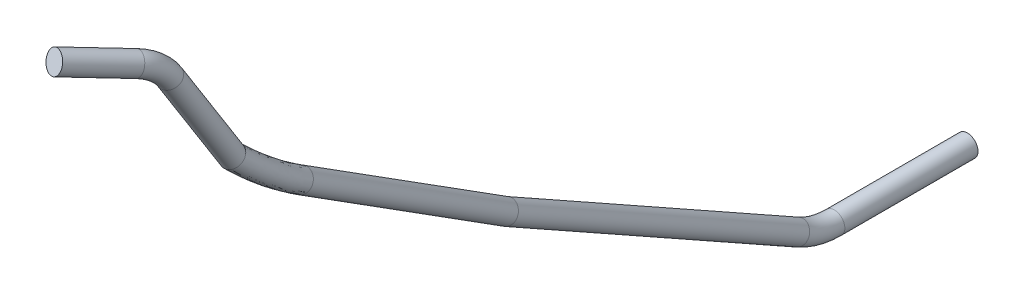
ISO-10303-21;
HEADER;
FILE_DESCRIPTION(('STEP AP214'),'2;1');
FILE_NAME('part.step','',(''),(''),'','','');
FILE_SCHEMA(('AUTOMOTIVE_DESIGN { 1 0 10303 214 1 1 1 1 }'));
ENDSEC;
DATA;
#1=APPLICATION_CONTEXT('core data for automotive mechanical design processes');
#2=APPLICATION_PROTOCOL_DEFINITION('international standard','automotive_design',2000,#1);
#3=PRODUCT_CONTEXT('',#1,'mechanical');
#4=PRODUCT('Part','Part','',(#3));
#5=PRODUCT_RELATED_PRODUCT_CATEGORY('part','',(#4));
#6=PRODUCT_DEFINITION_FORMATION('','',#4);
#7=PRODUCT_DEFINITION_CONTEXT('part definition',#1,'design');
#8=PRODUCT_DEFINITION('design','',#6,#7);
#9=PRODUCT_DEFINITION_SHAPE('','',#8);
#10=(LENGTH_UNIT() NAMED_UNIT(*) SI_UNIT(.MILLI.,.METRE.));
#11=(NAMED_UNIT(*) PLANE_ANGLE_UNIT() SI_UNIT($,.RADIAN.));
#12=(NAMED_UNIT(*) SI_UNIT($,.STERADIAN.) SOLID_ANGLE_UNIT());
#13=UNCERTAINTY_MEASURE_WITH_UNIT(LENGTH_MEASURE(1.E-05),#10,'distance_accuracy_value','');
#14=(GEOMETRIC_REPRESENTATION_CONTEXT(3) GLOBAL_UNCERTAINTY_ASSIGNED_CONTEXT((#13)) GLOBAL_UNIT_ASSIGNED_CONTEXT((#10,
#11,#12)) REPRESENTATION_CONTEXT('',''));
#15=CARTESIAN_POINT('',(0.,0.,0.));
#16=DIRECTION('',(0.,0.,1.));
#17=DIRECTION('',(1.,0.,0.));
#18=AXIS2_PLACEMENT_3D('',#15,#16,#17);
#19=CARTESIAN_POINT('',(-510.773209160921,517.745133017637,1525.04513957571));
#20=DIRECTION('',(0.276276169765513,-0.333500478289716,-0.901359478232868));
#21=DIRECTION('',(0.,0.93786269894796,-0.34700656754887));
#22=AXIS2_PLACEMENT_3D('',#19,#20,#21);
#23=PLANE('',#22);
#24=CARTESIAN_POINT('',(-510.773209160921,517.745133017637,1525.04513957571));
#25=DIRECTION('',(0.276276169765513,-0.333500478289716,-0.901359478232868));
#26=DIRECTION('',(0.,0.93786269894796,-0.34700656754887));
#27=AXIS2_PLACEMENT_3D('',#24,#25,#26);
#28=CIRCLE('',#27,10.);
#29=CARTESIAN_POINT('',(-510.773209160921,527.123760007117,1521.57507390022));
#30=VERTEX_POINT('',#29);
#31=EDGE_CURVE('E48',#30,#30,#28,.T.);
#32=ORIENTED_EDGE('',*,*,#31,.F.);
#33=EDGE_LOOP('',(#32));
#34=FACE_BOUND('',#33,.T.);
#35=ADVANCED_FACE('F45',(#34),#23,.F.);
#36=CARTESIAN_POINT('',(-482.88979308778,48.2309975051512,693.979558270394));
#37=DIRECTION('',(0.,0.,-1.));
#38=DIRECTION('',(0.0684911380918414,0.997651724803242,0.));
#39=AXIS2_PLACEMENT_3D('',#36,#37,#38);
#40=PLANE('',#39);
#41=CARTESIAN_POINT('',(-482.88979308778,48.2309975051512,693.979558270394));
#42=DIRECTION('',(0.,0.,-1.));
#43=DIRECTION('',(0.0684911380918414,0.997651724803242,0.));
#44=AXIS2_PLACEMENT_3D('',#41,#42,#43);
#45=CIRCLE('',#44,10.);
#46=CARTESIAN_POINT('',(-482.204881706862,58.2075147531837,693.979558270394));
#47=VERTEX_POINT('',#46);
#48=EDGE_CURVE('E12',#47,#47,#45,.T.);
#49=ORIENTED_EDGE('',*,*,#48,.T.);
#50=EDGE_LOOP('',(#49));
#51=FACE_BOUND('',#50,.T.);
#52=ADVANCED_FACE('F111',(#51),#40,.T.);
#53=CARTESIAN_POINT('',(-508.911169223926,450.114013071726,1477.83973627585));
#54=DIRECTION('',(0.904338528167801,-0.227267213397239,0.361277511320521));
#55=DIRECTION('',(0.370985292650153,0.,-0.928638741727525));
#56=AXIS2_PLACEMENT_3D('',#53,#54,#55);
#57=TOROIDAL_SURFACE('',#56,50.0000000000003,10.);
#58=CARTESIAN_POINT('',(-487.570375446822,474.209237825209,1439.57760532314));
#59=DIRECTION('',(0.000186699067691753,-0.846237361114661,-0.5328060564569));
#60=DIRECTION('',(0.0954890480492274,0.530386484482647,-0.842360978904407));
#61=AXIS2_PLACEMENT_3D('',#58,#59,#60);
#62=CIRCLE('',#61,10.);
#63=CARTESIAN_POINT('',(-483.302216691401,479.028282775905,1431.9251791326));
#64=VERTEX_POINT('',#63);
#65=EDGE_CURVE('E97',#64,#64,#62,.T.);
#66=CARTESIAN_POINT('',(-492.644385238532,495.861336618991,1465.89929545339));
#67=DIRECTION('',(0.276276169765513,-0.333500478289716,-0.901359478232868));
#68=DIRECTION('',(0.,0.93786269894796,-0.34700656754887));
#69=AXIS2_PLACEMENT_3D('',#66,#67,#68);
#70=CIRCLE('',#69,10.);
#71=CARTESIAN_POINT('',(-489.391028441454,505.010801328442,1463.5112072889));
#72=VERTEX_POINT('',#71);
#73=EDGE_CURVE('E149',#72,#72,#70,.T.);
#74=CARTESIAN_POINT('',(-508.911169223926,450.114013071726,1477.83973627585));
#75=DIRECTION('',(0.904338528167801,-0.227267213397239,0.361277511320521));
#76=DIRECTION('',(0.370985292650153,0.,-0.928638741727525));
#77=AXIS2_PLACEMENT_3D('',#74,#75,#76);
#78=CIRCLE('',#77,60.0000000000003);
#79=EDGE_CURVE('',#64,#72,#78,.T.);
#80=ORIENTED_EDGE('',*,*,#65,.F.);
#81=ORIENTED_EDGE('',*,*,#73,.T.);
#82=ORIENTED_EDGE('',*,*,#79,.T.);
#83=ORIENTED_EDGE('',*,*,#79,.F.);
#84=EDGE_LOOP('',(#80,#82,#81,#83));
#85=FACE_BOUND('',#84,.T.);
#86=ADVANCED_FACE('F106',(#85),#57,.T.);
#87=CARTESIAN_POINT('',(-492.644385238532,495.861336618989,1465.89929545339));
#88=DIRECTION('',(-0.276276169765517,0.333500478289714,0.901359478232868));
#89=DIRECTION('',(0.,-0.93786269894796,0.347006567548869));
#90=AXIS2_PLACEMENT_3D('',#87,#88,#89);
#91=CYLINDRICAL_SURFACE('',#90,10.);
#92=ORIENTED_EDGE('',*,*,#31,.T.);
#93=EDGE_LOOP('',(#92));
#94=FACE_BOUND('',#93,.T.);
#95=ORIENTED_EDGE('',*,*,#73,.F.);
#96=EDGE_LOOP('',(#95));
#97=FACE_BOUND('',#96,.T.);
#98=ADVANCED_FACE('F110',(#94,#97),#91,.T.);
#99=CARTESIAN_POINT('',(-487.549230938787,378.369055535432,1379.23492616198));
#100=DIRECTION('',(-0.000186699067695459,0.84623736111466,0.532806056456901));
#101=DIRECTION('',(0.,-0.53280606574279,0.846237375863114));
#102=AXIS2_PLACEMENT_3D('',#99,#100,#101);
#103=CYLINDRICAL_SURFACE('',#102,10.);
#104=CARTESIAN_POINT('',(-478.669114475622,378.086138604802,1384.48941735097));
#105=CARTESIAN_POINT('',(-478.662993129697,378.093934910784,1384.48035219592));
#106=CARTESIAN_POINT('',(-478.656895292657,378.101737945794,1384.47127648724));
#107=CARTESIAN_POINT('',(-478.52197824618,378.27520067755,1384.26946145875));
#108=CARTESIAN_POINT('',(-478.403735906803,378.443848629474,1384.07202260607));
#109=CARTESIAN_POINT('',(-478.189387779546,378.7858441776,1383.66923844098));
#110=CARTESIAN_POINT('',(-478.093293947711,378.959194255904,1383.46388892778));
#111=CARTESIAN_POINT('',(-477.923787516122,379.309724497188,1383.04631278206));
#112=CARTESIAN_POINT('',(-477.850425295129,379.486912249326,1382.8340720099));
#113=CARTESIAN_POINT('',(-477.727175609425,379.843614330729,1382.40450228013));
#114=CARTESIAN_POINT('',(-477.677306101837,380.023130332298,1382.18716956315));
#115=CARTESIAN_POINT('',(-477.601576644349,380.382748074651,1381.74952167354));
#116=CARTESIAN_POINT('',(-477.575672319506,380.562848110708,1381.52921278262));
#117=CARTESIAN_POINT('',(-477.547929160334,380.922763429279,1381.08668563078));
#118=CARTESIAN_POINT('',(-477.546101284487,381.102578544882,1380.86446654648));
#119=CARTESIAN_POINT('',(-477.566594790252,381.460556159507,1380.41980325884));
#120=CARTESIAN_POINT('',(-477.588916568563,381.638718631332,1380.19735905188));
#121=CARTESIAN_POINT('',(-477.657581313641,381.992021492111,1379.75395019945));
#122=CARTESIAN_POINT('',(-477.703913199185,382.167163236705,1379.53298491905));
#123=CARTESIAN_POINT('',(-477.820119533795,382.512676132922,1379.09473880854));
#124=CARTESIAN_POINT('',(-477.88991717385,382.683060909519,1378.8774483562));
#125=CARTESIAN_POINT('',(-478.052561364108,383.018249141319,1378.44759687986));
#126=CARTESIAN_POINT('',(-478.145385660272,383.183057811787,1378.23503150421));
#127=CARTESIAN_POINT('',(-478.353547884815,383.506137522083,1377.8158576317));
#128=CARTESIAN_POINT('',(-478.468896444814,383.664405431713,1377.60925200096));
#129=CARTESIAN_POINT('',(-478.721320583853,383.973189086137,1377.20356669031));
#130=CARTESIAN_POINT('',(-478.858401025595,384.123703085914,1377.00448870716));
#131=CARTESIAN_POINT('',(-479.152067507544,384.414585692519,1376.61701974958));
#132=CARTESIAN_POINT('',(-479.308478762728,384.555029341731,1376.42855262594));
#133=CARTESIAN_POINT('',(-479.640621553467,384.826127551448,1376.06187345161));
#134=CARTESIAN_POINT('',(-479.816353314096,384.956781997886,1375.88366152042));
#135=CARTESIAN_POINT('',(-480.185885308199,385.207324595951,1375.53880990604));
#136=CARTESIAN_POINT('',(-480.379684216672,385.327213535832,1375.37216937578));
#137=CARTESIAN_POINT('',(-480.783985633648,385.555347538131,1375.05166507684));
#138=CARTESIAN_POINT('',(-480.994488249891,385.663592525436,1374.89780139059));
#139=CARTESIAN_POINT('',(-481.428961192961,385.866826333331,1374.60514199357));
#140=CARTESIAN_POINT('',(-481.652812035569,385.961913088954,1374.46623688469));
#141=CARTESIAN_POINT('',(-482.113869314488,386.139135122014,1374.20311952857));
#142=CARTESIAN_POINT('',(-482.351075398706,386.221270740673,1374.07890689425));
#143=CARTESIAN_POINT('',(-482.837149291059,386.371992997735,1373.84606572547));
#144=CARTESIAN_POINT('',(-483.086016931564,386.440579830822,1373.73743696709));
#145=CARTESIAN_POINT('',(-483.593632977505,386.563709276867,1373.53653783484));
#146=CARTESIAN_POINT('',(-483.85238137344,386.618251903328,1373.44426744524));
#147=CARTESIAN_POINT('',(-484.376850234036,386.712713913463,1373.27707274189));
#148=CARTESIAN_POINT('',(-484.642538734282,386.752690817248,1373.20208063743));
#149=CARTESIAN_POINT('',(-485.179980570903,386.8180488205,1373.06949032993));
#150=CARTESIAN_POINT('',(-485.451733885574,386.843429972193,1373.01189206466));
#151=CARTESIAN_POINT('',(-485.999376050314,386.879430115634,1372.91447650805));
#152=CARTESIAN_POINT('',(-486.275264945257,386.890048947079,1372.87465940981));
#153=CARTESIAN_POINT('',(-486.829219683874,386.896467898177,1372.81306239052));
#154=CARTESIAN_POINT('',(-487.107285533231,386.892267979126,1372.79128251658));
#155=CARTESIAN_POINT('',(-487.664140220088,386.869081805176,1372.76585943647));
#156=CARTESIAN_POINT('',(-487.942929449125,386.850068489573,1372.76224951279));
#157=CARTESIAN_POINT('',(-488.498756859029,386.79738471713,1372.7732463841));
#158=CARTESIAN_POINT('',(-488.775795039071,386.763714253383,1372.78785318768));
#159=CARTESIAN_POINT('',(-489.326160341181,386.681986995313,1372.83514160247));
#160=CARTESIAN_POINT('',(-489.599487729363,386.633931238365,1372.86782191049));
#161=CARTESIAN_POINT('',(-490.140551157858,386.523801858656,1372.95098913939));
#162=CARTESIAN_POINT('',(-490.408287179016,386.461728187881,1373.00147612126));
#163=CARTESIAN_POINT('',(-490.93806822879,386.32357264448,1373.12025949041));
#164=CARTESIAN_POINT('',(-491.200063843217,386.247400748695,1373.18867157536));
#165=CARTESIAN_POINT('',(-491.714702667901,386.08189154658,1373.34262900293));
#166=CARTESIAN_POINT('',(-491.96734559039,385.99255383558,1373.42817487221));
#167=CARTESIAN_POINT('',(-492.461656336918,385.801321941284,1373.61581537703));
#168=CARTESIAN_POINT('',(-492.703318413072,385.69942128326,1373.71791855456));
#169=CARTESIAN_POINT('',(-493.173862718965,385.483843048954,1373.93789773904));
#170=CARTESIAN_POINT('',(-493.402745236371,385.370165737929,1374.05577339074));
#171=CARTESIAN_POINT('',(-493.849901827788,385.129843768762,1374.30856427055));
#172=CARTESIAN_POINT('',(-494.067933138663,385.003013372727,1374.44373245249));
#173=CARTESIAN_POINT('',(-494.487637442146,384.738948354546,1374.72851946913));
#174=CARTESIAN_POINT('',(-494.689310740121,384.60171392671,1374.87813803397));
#175=CARTESIAN_POINT('',(-495.074557447383,384.318082982038,1375.19047451137));
#176=CARTESIAN_POINT('',(-495.258160967227,384.171702395113,1375.35316978237));
#177=CARTESIAN_POINT('',(-495.606301108503,383.870676874761,1375.69065669564));
#178=CARTESIAN_POINT('',(-495.77084794143,383.716036432889,1375.86544177866));
#179=CARTESIAN_POINT('',(-496.01315698327,383.467835481431,1376.14813833154));
#180=CARTESIAN_POINT('',(-496.097746802385,383.376689034113,1376.25238858815));
#181=CARTESIAN_POINT('',(-496.260185392214,383.19232420307,1376.46411995269));
#182=CARTESIAN_POINT('',(-496.338038807022,383.099107303343,1376.57159876486));
#183=CARTESIAN_POINT('',(-496.418421402111,382.997393546252,1376.68933028367));
#184=CARTESIAN_POINT('',(-496.424372906815,382.989828551148,1376.69808929787));
#185=CARTESIAN_POINT('',(-496.430302155483,382.982257577575,1376.70685792588));
#186=B_SPLINE_CURVE_WITH_KNOTS('',3,(#104,#105,#106,#107,#108,#109,#110,#111,#112,#113,#114,
#115,#116,#117,#118,#119,#120,#121,#122,#123,#124,#125,#126,#127,#128,#129,#130,#131,#132,#133,
#134,#135,#136,#137,#138,#139,#140,#141,#142,#143,#144,#145,#146,#147,#148,#149,#150,#151,#152,
#153,#154,#155,#156,#157,#158,#159,#160,#161,#162,#163,#164,#165,#166,#167,#168,#169,#170,#171,
#172,#173,#174,#175,#176,#177,#178,#179,#180,#181,#182,#183,#184,#185),.UNSPECIFIED.,.F.,.F.,(4,
2,2,2,2,2,2,2,2,2,2,2,2,2,2,2,2,2,2,2,2,2,2,2,2,2,2,2,2,2,2,2,2,2,2,2,2,2,2,2,4),(0.,
0.0402982036311879,0.895072024434754,1.75030618789731,2.60742242016678,3.46519274748777,
4.32137159349368,5.17794011892683,6.03452271517708,6.89071033025851,7.74412229121158,
8.59671266635808,9.4497064474532,10.3028913635743,11.1488600321391,11.9948385568444,
12.8407550882546,13.686677076254,14.5259187066739,15.3651382219519,16.2043456775288,
17.0435523262327,17.8794080741336,18.715260831283,19.551122664783,20.3869866814279,
21.2243812219297,22.0617761569949,22.8991107190465,23.7364481491831,24.5793293376308,
25.4222364386441,26.2655797900381,27.1089041500956,27.9663936625348,28.8238671639325,
29.6798867229593,30.535445441964,31.0221002647636,31.508416867894,31.5474594090479),.UNSPECIFIED.);
#187=CARTESIAN_POINT('',(-478.669114475622,378.086138604802,1384.48941735097));
#188=VERTEX_POINT('',#187);
#189=CARTESIAN_POINT('',(-496.430302155483,382.982257577575,1376.70685792588));
#190=VERTEX_POINT('',#189);
#191=EDGE_CURVE('E78',#188,#190,#186,.T.);
#192=ORIENTED_EDGE('',*,*,#191,.T.);
#193=CARTESIAN_POINT('',(-478.669114475622,378.086138604802,1384.48941735097));
#194=CARTESIAN_POINT('',(-478.675235050756,378.07833314002,1384.49847514978));
#195=CARTESIAN_POINT('',(-478.681379413699,378.070534008548,1384.50752279865));
#196=CARTESIAN_POINT('',(-478.818386836975,377.897439676585,1384.70826454955));
#197=CARTESIAN_POINT('',(-478.959902734105,377.735019541787,1384.89536529245));
#198=CARTESIAN_POINT('',(-479.26322259874,377.417202634959,1385.25890855017));
#199=CARTESIAN_POINT('',(-479.425037443763,377.26180968976,1385.43534527483));
#200=CARTESIAN_POINT('',(-479.768181628337,376.95885642167,1385.77663380081));
#201=CARTESIAN_POINT('',(-479.949553110378,376.811314079834,1385.94145926542));
#202=CARTESIAN_POINT('',(-480.330380406983,376.525393227872,1386.25801835056));
#203=CARTESIAN_POINT('',(-480.529849930431,376.387021804147,1386.40974187397));
#204=CARTESIAN_POINT('',(-480.944973200159,376.120808136234,1386.69859326929));
#205=CARTESIAN_POINT('',(-481.160596417211,375.992946942451,1386.83574754569));
#206=CARTESIAN_POINT('',(-481.606938093665,375.748343403015,1387.09483713652));
#207=CARTESIAN_POINT('',(-481.837663379514,375.631606144982,1387.21676549509));
#208=CARTESIAN_POINT('',(-482.312498674599,375.410171562563,1387.44443050278));
#209=CARTESIAN_POINT('',(-482.556608884659,375.305474418897,1387.55016690888));
#210=CARTESIAN_POINT('',(-483.056366417972,375.108945166143,1387.7446073122));
#211=CARTESIAN_POINT('',(-483.312008365642,375.017107142994,1387.83331914623));
#212=CARTESIAN_POINT('',(-483.832218424556,374.847222021669,1387.99281930445));
#213=CARTESIAN_POINT('',(-484.096752888692,374.769128673034,1388.06366809949));
#214=CARTESIAN_POINT('',(-484.633434028599,374.627008972894,1388.18722856326));
#215=CARTESIAN_POINT('',(-484.905573131744,374.562969152872,1388.23995762513));
#216=CARTESIAN_POINT('',(-485.455889411817,374.449328317888,1388.32697191664));
#217=CARTESIAN_POINT('',(-485.734069378128,374.399734132416,1388.36124842892));
#218=CARTESIAN_POINT('',(-486.294400255758,374.31540771895,1388.4110353681));
#219=CARTESIAN_POINT('',(-486.576552042332,374.280678821449,1388.42654159104));
#220=CARTESIAN_POINT('',(-487.140278833171,374.22661719347,1388.43856962611));
#221=CARTESIAN_POINT('',(-487.421837942713,374.20715466914,1388.43525350089));
#222=CARTESIAN_POINT('',(-487.984764795839,374.183300774878,1388.41000130141));
#223=CARTESIAN_POINT('',(-488.266132537139,374.178909581747,1388.38806500874));
#224=CARTESIAN_POINT('',(-488.826619290101,374.185255847581,1388.32570147695));
#225=CARTESIAN_POINT('',(-489.105738464337,374.195992202757,1388.28527558709));
#226=CARTESIAN_POINT('',(-489.659726880241,374.232535387789,1388.18619945775));
#227=CARTESIAN_POINT('',(-489.934596093878,374.258342317001,1388.12754909813));
#228=CARTESIAN_POINT('',(-490.475964718138,374.324596484886,1387.99295673204));
#229=CARTESIAN_POINT('',(-490.742512620569,374.364928215296,1387.91715285858));
#230=CARTESIAN_POINT('',(-491.267533721823,374.459980806488,1387.74853539607));
#231=CARTESIAN_POINT('',(-491.526007131116,374.51470129186,1387.65572225082));
#232=CARTESIAN_POINT('',(-492.033027386257,374.638144281369,1387.45374510619));
#233=CARTESIAN_POINT('',(-492.28157435609,374.706866610551,1387.34458131113));
#234=CARTESIAN_POINT('',(-492.766964226614,374.857821218826,1387.11068429728));
#235=CARTESIAN_POINT('',(-493.003807135982,374.940053487901,1386.98595109005));
#236=CARTESIAN_POINT('',(-493.463238330205,375.117102826328,1386.72230746469));
#237=CARTESIAN_POINT('',(-493.685876449794,375.211871852393,1386.58345161475));
#238=CARTESIAN_POINT('',(-494.116285030197,375.413546758528,1386.29217630705));
#239=CARTESIAN_POINT('',(-494.324055542769,375.520452596343,1386.1397568965));
#240=CARTESIAN_POINT('',(-494.723274496101,375.745631299071,1385.82244797662));
#241=CARTESIAN_POINT('',(-494.914722844308,375.863904228429,1385.65755839659));
#242=CARTESIAN_POINT('',(-495.27996642617,376.110965205953,1385.31649215815));
#243=CARTESIAN_POINT('',(-495.453761606842,376.239753285676,1385.14031546587));
#244=CARTESIAN_POINT('',(-495.782829079179,376.507184436161,1384.77757598432));
#245=CARTESIAN_POINT('',(-495.938064006363,376.645846518708,1384.59099331731));
#246=CARTESIAN_POINT('',(-496.228551943711,376.931803379546,1384.20909541631));
#247=CARTESIAN_POINT('',(-496.363804970085,377.079098150835,1384.01378018939));
#248=CARTESIAN_POINT('',(-496.613416120191,377.381263034121,1383.61581360725));
#249=CARTESIAN_POINT('',(-496.727775110988,377.536132831429,1383.41316255687));
#250=CARTESIAN_POINT('',(-496.934851871187,377.852355331472,1383.00194794069));
#251=CARTESIAN_POINT('',(-497.027569445771,378.013708092551,1382.79338432168));
#252=CARTESIAN_POINT('',(-497.192031181013,378.344304767838,1382.36853803502));
#253=CARTESIAN_POINT('',(-497.263427879613,378.513632241879,1382.15218582432));
#254=CARTESIAN_POINT('',(-497.382828217657,378.856580867203,1381.71644671646));
#255=CARTESIAN_POINT('',(-497.430831385493,379.030202104972,1381.4970597582));
#256=CARTESIAN_POINT('',(-497.503170628501,379.380580601546,1381.05670949309));
#257=CARTESIAN_POINT('',(-497.527494713375,379.55733940303,1380.83574544465));
#258=CARTESIAN_POINT('',(-497.552308357884,379.912641647088,1380.39392854758));
#259=CARTESIAN_POINT('',(-497.5527987651,380.091185025973,1380.17307569528));
#260=CARTESIAN_POINT('',(-497.529981761293,380.448892329533,1379.73291726758));
#261=CARTESIAN_POINT('',(-497.506661814373,380.628056531546,1379.5136125685));
#262=CARTESIAN_POINT('',(-497.436405886527,380.985649763547,1379.07820939329));
#263=CARTESIAN_POINT('',(-497.389469992386,381.164078796234,1378.86211090538));
#264=CARTESIAN_POINT('',(-497.272448936523,381.518635818493,1378.43501127496));
#265=CARTESIAN_POINT('',(-497.202403882976,381.694767249032,1378.22400197582));
#266=CARTESIAN_POINT('',(-497.039680147231,382.043747636565,1377.8082443148));
#267=CARTESIAN_POINT('',(-496.947013454038,382.216598280182,1377.60349270094));
#268=CARTESIAN_POINT('',(-496.784467258654,382.484203187246,1377.28835509349));
#269=CARTESIAN_POINT('',(-496.722006246479,382.58047589094,1377.17536967274));
#270=CARTESIAN_POINT('',(-496.590163685169,382.771329078121,1376.95216475641));
#271=CARTESIAN_POINT('',(-496.520786880757,382.865910670001,1376.84194342857));
#272=CARTESIAN_POINT('',(-496.442139963331,382.967126670224,1376.72441895122));
#273=CARTESIAN_POINT('',(-496.43623210725,382.974695234097,1376.71563351766));
#274=CARTESIAN_POINT('',(-496.430302155483,382.982257577575,1376.70685792588));
#275=B_SPLINE_CURVE_WITH_KNOTS('',3,(#193,#194,#195,#196,#197,#198,#199,#200,#201,#202,#203,
#204,#205,#206,#207,#208,#209,#210,#211,#212,#213,#214,#215,#216,#217,#218,#219,#220,#221,#222,
#223,#224,#225,#226,#227,#228,#229,#230,#231,#232,#233,#234,#235,#236,#237,#238,#239,#240,#241,
#242,#243,#244,#245,#246,#247,#248,#249,#250,#251,#252,#253,#254,#255,#256,#257,#258,#259,#260,
#261,#262,#263,#264,#265,#266,#267,#268,#269,#270,#271,#272,#273,#274),.UNSPECIFIED.,.F.,.F.,(4,
2,2,2,2,2,2,2,2,2,2,2,2,2,2,2,2,2,2,2,2,2,2,2,2,2,2,2,2,2,2,2,2,2,2,2,2,2,2,2,4),(0.,
0.0402982190755889,0.895115756452579,1.75039333416005,2.60755223992403,3.46536593423655,
4.32159745223435,5.1782187136332,6.03485283104101,6.89109166904333,7.74439178277661,
8.59687051055848,9.44975161464495,10.3028237025977,11.1485619435424,11.9943101057213,
12.8399965605697,13.6856885908621,14.5247986295333,15.3638867776155,16.2029644417753,
17.042041483804,17.87799144549,18.7139384968843,19.5498902880608,20.3858445880716,
21.2234544176535,22.0610635677983,22.898637950789,23.7362198734526,24.5867877839976,
25.4373728411033,26.2883883824568,27.139373659649,27.9908072026135,28.842237616759,
29.6921979976806,30.5417088913264,31.0246953114949,31.5073526200083,31.5463951468787),.UNSPECIFIED.);
#276=EDGE_CURVE('E74',#188,#190,#275,.T.);
#277=ORIENTED_EDGE('',*,*,#276,.F.);
#278=EDGE_LOOP('',(#192,#277));
#279=FACE_BOUND('',#278,.T.);
#280=ORIENTED_EDGE('',*,*,#65,.T.);
#281=EDGE_LOOP('',(#280));
#282=FACE_BOUND('',#281,.T.);
#283=ADVANCED_FACE('F82',(#279,#282),#103,.T.);
#284=CARTESIAN_POINT('',(-482.88979308778,210.794167038828,1127.19481864821));
#285=DIRECTION('',(0.,0.534844690679892,0.844950387213078));
#286=DIRECTION('',(0.,-0.844950387213078,0.534844690679892));
#287=AXIS2_PLACEMENT_3D('',#284,#285,#286);
#288=CYLINDRICAL_SURFACE('',#287,10.);
#289=CARTESIAN_POINT('',(-482.88979308778,211.024040943275,1127.55797462219));
#290=DIRECTION('',(0.,0.512339000942188,0.858783295199412));
#291=DIRECTION('',(0.,-0.858783295199412,0.512339000942188));
#292=AXIS2_PLACEMENT_3D('',#289,#290,#291);
#293=ELLIPSE('',#292,10.0034904950001,10.);
#294=CARTESIAN_POINT('',(-482.889793087779,202.433210412483,1132.68315294834));
#295=VERTEX_POINT('',#294);
#296=EDGE_CURVE('E64',#295,#295,#293,.T.);
#297=ORIENTED_EDGE('',*,*,#296,.T.);
#298=EDGE_LOOP('',(#297));
#299=FACE_BOUND('',#298,.T.);
#300=CARTESIAN_POINT('',(-482.88979308778,333.201927063564,1320.57522614428));
#301=DIRECTION('',(0.,-0.534844690679894,-0.844950387213077));
#302=DIRECTION('',(0.0684911380918414,0.842966211176294,-0.533588728158653));
#303=AXIS2_PLACEMENT_3D('',#300,#301,#302);
#304=CIRCLE('',#303,10.);
#305=CARTESIAN_POINT('',(-482.204881706861,341.631589175327,1315.23933886269));
#306=VERTEX_POINT('',#305);
#307=EDGE_CURVE('E80',#306,#306,#304,.T.);
#308=ORIENTED_EDGE('',*,*,#307,.T.);
#309=EDGE_LOOP('',(#308));
#310=FACE_BOUND('',#309,.T.);
#311=ADVANCED_FACE('F105',(#299,#310),#288,.T.);
#312=CARTESIAN_POINT('',(-482.204881706861,341.631589175327,1315.23933886269));
#313=CARTESIAN_POINT('',(-482.204881706861,341.842678382347,1315.57281867527));
#314=CARTESIAN_POINT('',(-482.205252941643,342.048790655843,1315.89726060842));
#315=CARTESIAN_POINT('',(-482.206737870567,342.467581896941,1316.55416801588));
#316=CARTESIAN_POINT('',(-482.207851564698,342.677506959207,1316.88228285621));
#317=CARTESIAN_POINT('',(-482.212306306513,343.308866138902,1317.86560403674));
#318=CARTESIAN_POINT('',(-482.216761018493,343.731884257328,1318.51978703413));
#319=CARTESIAN_POINT('',(-482.234579398032,345.007239616458,1320.47818867));
#320=CARTESIAN_POINT('',(-482.25239738809,345.865878002399,1321.77825992625));
#321=CARTESIAN_POINT('',(-482.323662488248,348.46671240046,1325.6614528828));
#322=CARTESIAN_POINT('',(-482.394922044,350.23382986609,1328.22755310514));
#323=CARTESIAN_POINT('',(-482.679854153522,355.632502513231,1335.85433572713));
#324=CARTESIAN_POINT('',(-482.964701883828,359.361409017858,1340.84348036232));
#325=CARTESIAN_POINT('',(-483.723163838868,367.065394526452,1350.61305733645));
#326=CARTESIAN_POINT('',(-484.196777243419,371.04046522939,1355.39347915047));
#327=CARTESIAN_POINT('',(-485.047494081311,377.176962461273,1362.39465985342));
#328=CARTESIAN_POINT('',(-485.354443871446,379.251437204276,1364.70015166987));
#329=CARTESIAN_POINT('',(-485.849730059731,382.40522608809,1368.11449426844));
#330=CARTESIAN_POINT('',(-486.020635405816,383.463501578008,1369.24529314399));
#331=CARTESIAN_POINT('',(-486.285680157658,385.061258207691,1370.93033062867));
#332=CARTESIAN_POINT('',(-486.375476179593,385.595567636904,1371.49014968802));
#333=CARTESIAN_POINT('',(-486.512338192105,386.399595584947,1372.32706496844));
#334=CARTESIAN_POINT('',(-486.558320191844,386.668032200786,1372.60556784601));
#335=CARTESIAN_POINT('',(-486.651006223833,387.205756354361,1373.16163200513));
#336=CARTESIAN_POINT('',(-486.697088275623,387.471478859127,1373.43553036069));
#337=CARTESIAN_POINT('',(-486.795633286558,388.03620651146,1374.01570581206));
#338=CARTESIAN_POINT('',(-486.84781892177,388.33526300489,1374.32294200561));
#339=CARTESIAN_POINT('',(-486.950862855602,388.925770960899,1374.9296021484));
#340=CARTESIAN_POINT('',(-487.002384822522,389.221024938919,1375.23293221981));
#341=CARTESIAN_POINT('',(-487.053906789403,389.516278916876,1375.53626229107));
#342=CARTESIAN_POINT('',(-462.251847210796,340.474156902299,1315.97198129403));
#343=CARTESIAN_POINT('',(-462.251847210796,340.689030436277,1316.31143960576));
#344=CARTESIAN_POINT('',(-462.252231932244,340.906514976981,1316.6538048075));
#345=CARTESIAN_POINT('',(-462.253770807431,341.340520566947,1317.33457713261));
#346=CARTESIAN_POINT('',(-462.254924961173,341.558072037865,1317.67461212112));
#347=CARTESIAN_POINT('',(-462.259541540191,342.212367988605,1318.69365656909));
#348=CARTESIAN_POINT('',(-462.264158088273,342.650754014998,1319.37160550852));
#349=CARTESIAN_POINT('',(-462.282623795176,343.972442008315,1321.40115430025));
#350=CARTESIAN_POINT('',(-462.30108909843,344.862274036134,1322.7484560994));
#351=CARTESIAN_POINT('',(-462.374943202554,347.557594655384,1326.77272233218));
#352=CARTESIAN_POINT('',(-462.448791560562,349.388910077228,1329.43204691116));
#353=CARTESIAN_POINT('',(-462.744075024217,354.983712158024,1337.33590441034));
#354=CARTESIAN_POINT('',(-463.039271043627,358.848086836955,1342.50630065617));
#355=CARTESIAN_POINT('',(-463.825287311145,366.831951940466,1352.63079850286));
#356=CARTESIAN_POINT('',(-464.316106709904,370.951433764744,1357.58488919512));
#357=CARTESIAN_POINT('',(-465.197729405925,377.310865004264,1364.84041716115));
#358=CARTESIAN_POINT('',(-465.515830435011,379.460703745899,1367.22966564057));
#359=CARTESIAN_POINT('',(-466.029109972162,382.729067242651,1370.76804855878));
#360=CARTESIAN_POINT('',(-466.206224171945,383.825789029739,1371.93992844785));
#361=CARTESIAN_POINT('',(-466.480897786407,385.481590872483,1373.68618198877));
#362=CARTESIAN_POINT('',(-466.573956025553,386.035311333381,1374.26633882422));
#363=CARTESIAN_POINT('',(-466.715790124914,386.868548969982,1375.13365856345));
#364=CARTESIAN_POINT('',(-466.763442613696,387.14673767216,1375.42227922653));
#365=CARTESIAN_POINT('',(-466.859495854671,387.703996911557,1375.99854474922));
#366=CARTESIAN_POINT('',(-466.908129543775,387.984401617048,1376.28755987821));
#367=CARTESIAN_POINT('',(-467.008441226413,388.559253485102,1376.87813650173));
#368=CARTESIAN_POINT('',(-467.059715096382,388.853084951092,1377.18000473282));
#369=CARTESIAN_POINT('',(-467.16275903019,389.443592907101,1377.78666487561));
#370=CARTESIAN_POINT('',(-467.214280997129,389.738846885122,1378.08999494703));
#371=CARTESIAN_POINT('',(-467.265802964003,390.034100863079,1378.39332501828));
#372=CARTESIAN_POINT('',(-463.621669972633,323.614832678774,1326.64375585721));
#373=CARTESIAN_POINT('',(-463.621669972633,323.835214023168,1326.9919154361));
#374=CARTESIAN_POINT('',(-463.622074322928,324.069250064991,1327.36036664117));
#375=CARTESIAN_POINT('',(-463.623691712959,324.525399024168,1328.07587260403));
#376=CARTESIAN_POINT('',(-463.62490475271,324.75405017369,1328.43325649427));
#377=CARTESIAN_POINT('',(-463.629756873858,325.441728913053,1329.50429353877));
#378=CARTESIAN_POINT('',(-463.634608962566,325.90248180263,1330.21683206427));
#379=CARTESIAN_POINT('',(-463.654016806952,327.291603547878,1332.34993032485));
#380=CARTESIAN_POINT('',(-463.673424227268,328.226835634122,1333.76597271614));
#381=CARTESIAN_POINT('',(-463.751046436399,331.059674021067,1337.99556075899));
#382=CARTESIAN_POINT('',(-463.828662606564,332.984424860368,1340.79056655476));
#383=CARTESIAN_POINT('',(-464.139011707209,338.86467895273,1349.09768621926));
#384=CARTESIAN_POINT('',(-464.449268902386,342.926217624403,1354.53188089773));
#385=CARTESIAN_POINT('',(-465.275388451952,351.317426960395,1365.17294004983));
#386=CARTESIAN_POINT('',(-465.791249912989,355.647088581897,1370.37979306187));
#387=CARTESIAN_POINT('',(-466.717853820181,362.330983923926,1378.00550482004));
#388=CARTESIAN_POINT('',(-467.052184659943,364.590509439351,1380.51665498158));
#389=CARTESIAN_POINT('',(-467.591652196732,368.02562788523,1384.2355694901));
#390=CARTESIAN_POINT('',(-467.777802927879,369.178305438992,1385.46723978211));
#391=CARTESIAN_POINT('',(-468.066490646,370.918587833013,1387.30258880481));
#392=CARTESIAN_POINT('',(-468.164296803152,371.500559627456,1387.91234578199));
#393=CARTESIAN_POINT('',(-468.313367410245,372.376309824051,1388.82391698188));
#394=CARTESIAN_POINT('',(-468.363451173398,372.668691972778,1389.12726333996));
#395=CARTESIAN_POINT('',(-468.464405140145,373.254383097457,1389.73293046597));
#396=CARTESIAN_POINT('',(-468.516752550233,373.556156669575,1390.04394695039));
#397=CARTESIAN_POINT('',(-468.619635494104,374.145743591136,1390.64966171739));
#398=CARTESIAN_POINT('',(-468.66958235652,374.431970412874,1390.9437172727));
#399=CARTESIAN_POINT('',(-468.772626290375,375.022478368883,1391.55037741549));
#400=CARTESIAN_POINT('',(-468.824148257272,375.317732346903,1391.8537074869));
#401=CARTESIAN_POINT('',(-468.875670224164,375.612986324861,1392.15703755815));
#402=CARTESIAN_POINT('',(-483.574704468698,324.772264951801,1325.91111342587));
#403=CARTESIAN_POINT('',(-483.574704468698,324.988861969238,1326.25329450561));
#404=CARTESIAN_POINT('',(-483.575095332332,325.211525743864,1326.60382244207));
#405=CARTESIAN_POINT('',(-483.576658776089,325.652460354151,1327.29546348732));
#406=CARTESIAN_POINT('',(-483.577831356228,325.873485095043,1327.64092722938));
#407=CARTESIAN_POINT('',(-483.582521640191,326.538227063327,1328.67624100637));
#408=CARTESIAN_POINT('',(-483.587211892786,326.983612044983,1329.36501358988));
#409=CARTESIAN_POINT('',(-483.605972409807,328.326401155977,1331.42696469459));
#410=CARTESIAN_POINT('',(-483.624732516906,329.230439600431,1332.79577654299));
#411=CARTESIAN_POINT('',(-483.699765722138,331.968791766054,1336.88429130961));
#412=CARTESIAN_POINT('',(-483.774793090002,333.829344649407,1339.58607274838));
#413=CARTESIAN_POINT('',(-484.074790836514,339.513469307583,1347.61611753676));
#414=CARTESIAN_POINT('',(-484.374699742587,343.439539806371,1352.86906060352));
#415=CARTESIAN_POINT('',(-485.173264979675,351.550869545316,1363.15519888378));
#416=CARTESIAN_POINT('',(-485.671920446593,355.736120046899,1368.18838301687));
#417=CARTESIAN_POINT('',(-486.567618495522,362.197081380757,1375.55974751249));
#418=CARTESIAN_POINT('',(-486.890798096378,364.381242897728,1377.98714101088));
#419=CARTESIAN_POINT('',(-487.412272284301,367.701786730669,1381.58201519976));
#420=CARTESIAN_POINT('',(-487.592214161795,368.816017987261,1382.77260447825));
#421=CARTESIAN_POINT('',(-487.871273017229,370.49825516822,1384.54673744471));
#422=CARTESIAN_POINT('',(-487.965816957159,371.06081593098,1385.13615664583));
#423=CARTESIAN_POINT('',(-488.109915477452,371.907356439016,1386.01732338685));
#424=CARTESIAN_POINT('',(-488.158328751536,372.189986501471,1386.31055195944));
#425=CARTESIAN_POINT('',(-488.255915509318,372.756142540194,1386.89601772189));
#426=CARTESIAN_POINT('',(-488.305711282103,373.043233911632,1387.19191743289));
#427=CARTESIAN_POINT('',(-488.406827554224,373.622696617517,1387.7872310277));
#428=CARTESIAN_POINT('',(-488.457686181931,373.914148466671,1388.08665454548));
#429=CARTESIAN_POINT('',(-488.560730115763,374.50465642268,1388.69331468827));
#430=CARTESIAN_POINT('',(-488.612252082683,374.799910400701,1388.99664475969));
#431=CARTESIAN_POINT('',(-488.663774049564,375.095164378658,1389.29997483094));
#432=CARTESIAN_POINT('',(-503.527738964763,325.929697224828,1325.17847099452));
#433=CARTESIAN_POINT('',(-503.527738964763,326.142509915308,1325.51467357512));
#434=CARTESIAN_POINT('',(-503.528116341735,326.353801422737,1325.84727824297));
#435=CARTESIAN_POINT('',(-503.52962583922,326.779521684135,1326.51505437062));
#436=CARTESIAN_POINT('',(-503.530757959747,326.992920016396,1326.84859796449));
#437=CARTESIAN_POINT('',(-503.535286406523,327.634725213602,1327.84818847398));
#438=CARTESIAN_POINT('',(-503.539814823006,328.064742287336,1328.51319511549));
#439=CARTESIAN_POINT('',(-503.557928012663,329.361198764075,1330.50399906434));
#440=CARTESIAN_POINT('',(-503.576040806544,330.23404356674,1331.82558036984));
#441=CARTESIAN_POINT('',(-503.648485007877,332.877909511041,1335.77302186023));
#442=CARTESIAN_POINT('',(-503.72092357344,334.674264438446,1338.381578942));
#443=CARTESIAN_POINT('',(-504.01056996582,340.162259662436,1346.13454885426));
#444=CARTESIAN_POINT('',(-504.300130582787,343.95286198834,1351.20624030932));
#445=CARTESIAN_POINT('',(-505.071141507399,351.784312130238,1361.13745771772));
#446=CARTESIAN_POINT('',(-505.552590980197,355.8251515119,1365.99697297186));
#447=CARTESIAN_POINT('',(-506.417383170863,362.063178837588,1373.11399020493));
#448=CARTESIAN_POINT('',(-506.729411532814,364.171976356105,1375.45762704018));
#449=CARTESIAN_POINT('',(-507.23289237187,367.377945576109,1378.92846090941));
#450=CARTESIAN_POINT('',(-507.40662539571,368.453730535531,1380.07796917439));
#451=CARTESIAN_POINT('',(-507.676055388458,370.077922503428,1381.7908860846));
#452=CARTESIAN_POINT('',(-507.767337111166,370.621072234504,1382.35996750967));
#453=CARTESIAN_POINT('',(-507.90646354466,371.438403053981,1383.21072979181));
#454=CARTESIAN_POINT('',(-507.953206329673,371.711281030164,1383.49384057892));
#455=CARTESIAN_POINT('',(-508.047425878491,372.257901982932,1384.0591049778));
#456=CARTESIAN_POINT('',(-508.094670013974,372.53031115369,1384.33988791539));
#457=CARTESIAN_POINT('',(-508.194019614345,373.099649643899,1384.92480033801));
#458=CARTESIAN_POINT('',(-508.245790007342,373.396326520469,1385.22959181827));
#459=CARTESIAN_POINT('',(-508.34883394115,373.986834476478,1385.83625196106));
#460=CARTESIAN_POINT('',(-508.400355908095,374.282088454498,1386.13958203247));
#461=CARTESIAN_POINT('',(-508.451877874963,374.577342432455,1386.44291210372));
#462=CARTESIAN_POINT('',(-502.157916202926,342.789021448354,1314.50669643135));
#463=CARTESIAN_POINT('',(-502.157916202926,342.996326328417,1314.83419774479));
#464=CARTESIAN_POINT('',(-502.158273951041,343.191066334705,1315.14071640935));
#465=CARTESIAN_POINT('',(-502.159704933703,343.594643226936,1315.77375889915));
#466=CARTESIAN_POINT('',(-502.160778168222,343.796941880549,1316.0899535913));
#467=CARTESIAN_POINT('',(-502.165071072834,344.405364289199,1317.03755150438));
#468=CARTESIAN_POINT('',(-502.169363948713,344.813014499659,1317.66796855974));
#469=CARTESIAN_POINT('',(-502.186535000887,346.042037224601,1319.55522303974));
#470=CARTESIAN_POINT('',(-502.203705677751,346.869481968663,1320.80806375309));
#471=CARTESIAN_POINT('',(-502.272381773943,349.375830145536,1324.55018343342));
#472=CARTESIAN_POINT('',(-502.341052527437,351.078749654952,1327.02305929912));
#473=CARTESIAN_POINT('',(-502.615633282828,356.281292868439,1334.37276704391));
#474=CARTESIAN_POINT('',(-502.890132724029,359.874731198762,1339.18066006847));
#475=CARTESIAN_POINT('',(-503.621040366592,367.298837112439,1348.59531617004));
#476=CARTESIAN_POINT('',(-504.077447776934,371.129496694037,1353.20206910582));
#477=CARTESIAN_POINT('',(-504.897258756697,377.043059918282,1359.94890254569));
#478=CARTESIAN_POINT('',(-505.193057307882,379.042170662652,1362.17063769917));
#479=CARTESIAN_POINT('',(-505.6703501473,382.08138493353,1365.46093997809));
#480=CARTESIAN_POINT('',(-505.835046639687,383.101214126278,1366.55065784013));
#481=CARTESIAN_POINT('',(-506.090462528909,384.640925542899,1368.17447926856));
#482=CARTESIAN_POINT('',(-506.176996333634,385.155823940428,1368.71396055181));
#483=CARTESIAN_POINT('',(-506.308886259296,385.930642199912,1369.52047137343));
#484=CARTESIAN_POINT('',(-506.353197769993,386.189326729412,1369.78885646549));
#485=CARTESIAN_POINT('',(-506.442516592994,386.707515797165,1370.32471926105));
#486=CARTESIAN_POINT('',(-506.486047007472,386.958556101207,1370.58350084317));
#487=CARTESIAN_POINT('',(-506.582825346702,387.513159537818,1371.15327512239));
#488=CARTESIAN_POINT('',(-506.635922747158,387.817441058687,1371.46587927839));
#489=CARTESIAN_POINT('',(-506.738966681013,388.407949014696,1372.07253942118));
#490=CARTESIAN_POINT('',(-506.790488647916,388.703202992716,1372.3758694926));
#491=CARTESIAN_POINT('',(-506.842010614802,388.998456970674,1372.67919956385));
#492=CARTESIAN_POINT('',(-482.204881706861,341.631589175327,1315.23933886269));
#493=CARTESIAN_POINT('',(-482.204881706861,341.842678382347,1315.57281867527));
#494=CARTESIAN_POINT('',(-482.205252941643,342.048790655843,1315.89726060842));
#495=CARTESIAN_POINT('',(-482.206737870567,342.467581896941,1316.55416801588));
#496=CARTESIAN_POINT('',(-482.207851564698,342.677506959207,1316.88228285621));
#497=CARTESIAN_POINT('',(-482.212306306513,343.308866138902,1317.86560403674));
#498=CARTESIAN_POINT('',(-482.216761018493,343.731884257328,1318.51978703413));
#499=CARTESIAN_POINT('',(-482.234579398032,345.007239616458,1320.47818867));
#500=CARTESIAN_POINT('',(-482.25239738809,345.865878002399,1321.77825992625));
#501=CARTESIAN_POINT('',(-482.323662488248,348.46671240046,1325.6614528828));
#502=CARTESIAN_POINT('',(-482.394922044,350.23382986609,1328.22755310514));
#503=CARTESIAN_POINT('',(-482.679854153522,355.632502513231,1335.85433572713));
#504=CARTESIAN_POINT('',(-482.964701883828,359.361409017858,1340.84348036232));
#505=CARTESIAN_POINT('',(-483.723163838868,367.065394526452,1350.61305733645));
#506=CARTESIAN_POINT('',(-484.196777243419,371.04046522939,1355.39347915047));
#507=CARTESIAN_POINT('',(-485.047494081311,377.176962461273,1362.39465985342));
#508=CARTESIAN_POINT('',(-485.354443871446,379.251437204276,1364.70015166987));
#509=CARTESIAN_POINT('',(-485.849730059731,382.40522608809,1368.11449426844));
#510=CARTESIAN_POINT('',(-486.020635405816,383.463501578008,1369.24529314399));
#511=CARTESIAN_POINT('',(-486.285680157658,385.061258207691,1370.93033062867));
#512=CARTESIAN_POINT('',(-486.375476179593,385.595567636904,1371.49014968802));
#513=CARTESIAN_POINT('',(-486.512338192105,386.399595584947,1372.32706496844));
#514=CARTESIAN_POINT('',(-486.558320191844,386.668032200786,1372.60556784601));
#515=CARTESIAN_POINT('',(-486.651006223833,387.205756354361,1373.16163200513));
#516=CARTESIAN_POINT('',(-486.697088275623,387.471478859127,1373.43553036069));
#517=CARTESIAN_POINT('',(-486.795633286558,388.03620651146,1374.01570581206));
#518=CARTESIAN_POINT('',(-486.84781892177,388.33526300489,1374.32294200561));
#519=CARTESIAN_POINT('',(-486.950862855602,388.925770960899,1374.9296021484));
#520=CARTESIAN_POINT('',(-487.002384822522,389.221024938919,1375.23293221981));
#521=CARTESIAN_POINT('',(-487.053906789403,389.516278916876,1375.53626229107));
#522=(BOUNDED_SURFACE() B_SPLINE_SURFACE(3,3,((#312,#313,#314,#315,#316,#317,#318,#319,#320,
#321,#322,#323,#324,#325,#326,#327,#328,#329,#330,#331,#332,#333,#334,#335,#336,#337,#338,#339,
#340,#341),(#342,#343,#344,#345,#346,#347,#348,#349,#350,#351,#352,#353,#354,#355,#356,#357,
#358,#359,#360,#361,#362,#363,#364,#365,#366,#367,#368,#369,#370,#371),(#372,#373,#374,#375,
#376,#377,#378,#379,#380,#381,#382,#383,#384,#385,#386,#387,#388,#389,#390,#391,#392,#393,#394,
#395,#396,#397,#398,#399,#400,#401),(#402,#403,#404,#405,#406,#407,#408,#409,#410,#411,#412,
#413,#414,#415,#416,#417,#418,#419,#420,#421,#422,#423,#424,#425,#426,#427,#428,#429,#430,#431),
(#432,#433,#434,#435,#436,#437,#438,#439,#440,#441,#442,#443,#444,#445,#446,#447,#448,#449,#450,
#451,#452,#453,#454,#455,#456,#457,#458,#459,#460,#461),(#462,#463,#464,#465,#466,#467,#468,
#469,#470,#471,#472,#473,#474,#475,#476,#477,#478,#479,#480,#481,#482,#483,#484,#485,#486,#487,
#488,#489,#490,#491),(#492,#493,#494,#495,#496,#497,#498,#499,#500,#501,#502,#503,#504,#505,
#506,#507,#508,#509,#510,#511,#512,#513,#514,#515,#516,#517,#518,#519,#520,#521)),.UNSPECIFIED.,
.T.,.F.,.F.) B_SPLINE_SURFACE_WITH_KNOTS((4,3,4),(4,2,2,2,2,2,2,2,2,2,2,2,2,2,4),(0.,0.5,1.),
(0.748474987188473,0.752405065513653,0.756335143838833,0.764195300489193,0.779915613789914,
0.811356240391355,0.874237493594237,0.937118746797118,0.968559373398559,0.98427968669928,
0.99213984334964,0.99606992167482,1.,1.00419146313735,1.00838292627471),
.UNSPECIFIED.) GEOMETRIC_REPRESENTATION_ITEM() RATIONAL_B_SPLINE_SURFACE(((1.,1.,1.,1.,1.,1.,1.,
1.,1.,1.,1.,1.,1.,1.,1.,1.,1.,1.,1.,1.,1.,1.,1.,1.,1.,1.,1.,1.,1.,1.),(0.333333333333333,
0.333333333333333,0.333333333333333,0.333333333333333,0.333333333333333,0.333333333333333,
0.333333333333333,0.333333333333333,0.333333333333333,0.333333333333333,0.333333333333333,
0.333333333333333,0.333333333333333,0.333333333333333,0.333333333333333,0.333333333333333,
0.333333333333333,0.333333333333333,0.333333333333333,0.333333333333333,0.333333333333333,
0.333333333333333,0.333333333333333,0.333333333333333,0.333333333333333,0.333333333333333,
0.333333333333333,0.333333333333333,0.333333333333333,0.333333333333333),(0.333333333333333,
0.333333333333333,0.333333333333333,0.333333333333333,0.333333333333333,0.333333333333333,
0.333333333333333,0.333333333333333,0.333333333333333,0.333333333333333,0.333333333333333,
0.333333333333333,0.333333333333333,0.333333333333333,0.333333333333333,0.333333333333333,
0.333333333333333,0.333333333333333,0.333333333333333,0.333333333333333,0.333333333333333,
0.333333333333333,0.333333333333333,0.333333333333333,0.333333333333333,0.333333333333333,
0.333333333333333,0.333333333333333,0.333333333333333,0.333333333333333),(1.,1.,1.,1.,1.,1.,1.,
1.,1.,1.,1.,1.,1.,1.,1.,1.,1.,1.,1.,1.,1.,1.,1.,1.,1.,1.,1.,1.,1.,1.),(0.333333333333333,
0.333333333333333,0.333333333333333,0.333333333333333,0.333333333333333,0.333333333333333,
0.333333333333333,0.333333333333333,0.333333333333333,0.333333333333333,0.333333333333333,
0.333333333333333,0.333333333333333,0.333333333333333,0.333333333333333,0.333333333333333,
0.333333333333333,0.333333333333333,0.333333333333333,0.333333333333333,0.333333333333333,
0.333333333333333,0.333333333333333,0.333333333333333,0.333333333333333,0.333333333333333,
0.333333333333333,0.333333333333333,0.333333333333333,0.333333333333333),(0.333333333333333,
0.333333333333333,0.333333333333333,0.333333333333333,0.333333333333333,0.333333333333333,
0.333333333333333,0.333333333333333,0.333333333333333,0.333333333333333,0.333333333333333,
0.333333333333333,0.333333333333333,0.333333333333333,0.333333333333333,0.333333333333333,
0.333333333333333,0.333333333333333,0.333333333333333,0.333333333333333,0.333333333333333,
0.333333333333333,0.333333333333333,0.333333333333333,0.333333333333333,0.333333333333333,
0.333333333333333,0.333333333333333,0.333333333333333,0.333333333333333),(1.,1.,1.,1.,1.,1.,1.,
1.,1.,1.,1.,1.,1.,1.,1.,1.,1.,1.,1.,1.,1.,1.,1.,1.,1.,1.,1.,1.,1.,1.))) REPRESENTATION_ITEM('') SURFACE());
#523=ORIENTED_EDGE('',*,*,#276,.T.);
#524=ORIENTED_EDGE('',*,*,#191,.F.);
#525=EDGE_LOOP('',(#523,#524));
#526=FACE_BOUND('',#525,.T.);
#527=ORIENTED_EDGE('',*,*,#307,.F.);
#528=EDGE_LOOP('',(#527));
#529=FACE_BOUND('',#528,.T.);
#530=ADVANCED_FACE('F76',(#526,#529),#522,.F.);
#531=CARTESIAN_POINT('',(-482.88979308778,48.2309975051512,693.979558270394));
#532=DIRECTION('',(0.,0.,1.));
#533=DIRECTION('',(1.,0.,0.));
#534=AXIS2_PLACEMENT_3D('',#531,#532,#533);
#535=CYLINDRICAL_SURFACE('',#534,10.);
#536=CARTESIAN_POINT('',(-482.88979308778,48.2309975051512,819.234028481902));
#537=DIRECTION('',(0.,0.,-1.));
#538=DIRECTION('',(0.0684911380918414,0.997651724803242,0.));
#539=AXIS2_PLACEMENT_3D('',#536,#537,#538);
#540=CIRCLE('',#539,10.);
#541=CARTESIAN_POINT('',(-482.88979308778,38.2309975051512,819.234028481902));
#542=VERTEX_POINT('',#541);
#543=EDGE_CURVE('E53',#542,#542,#540,.T.);
#544=ORIENTED_EDGE('',*,*,#543,.T.);
#545=EDGE_LOOP('',(#544));
#546=FACE_BOUND('',#545,.T.);
#547=ORIENTED_EDGE('',*,*,#48,.F.);
#548=EDGE_LOOP('',(#547));
#549=FACE_BOUND('',#548,.T.);
#550=ADVANCED_FACE('F129',(#546,#549),#535,.T.);
#551=CARTESIAN_POINT('',(-482.88979308778,118.230997505152,819.234028481902));
#552=DIRECTION('',(-1.,0.,0.));
#553=DIRECTION('',(0.,0.,1.));
#554=AXIS2_PLACEMENT_3D('',#551,#552,#553);
#555=TOROIDAL_SURFACE('',#554,70.0000000000004,10.);
#556=CARTESIAN_POINT('',(-482.88979308778,57.1898147421853,853.497332568026));
#557=DIRECTION('',(0.,-0.489475772658911,-0.8720168966138));
#558=DIRECTION('',(0.0684911380918414,0.869969160964328,-0.488326348842562));
#559=AXIS2_PLACEMENT_3D('',#556,#557,#558);
#560=CIRCLE('',#559,10.);
#561=CARTESIAN_POINT('',(-482.88979308778,48.4696457760472,858.392090294615));
#562=VERTEX_POINT('',#561);
#563=EDGE_CURVE('E85',#562,#562,#560,.T.);
#564=CARTESIAN_POINT('',(-482.88979308778,118.230997505152,819.234028481902));
#565=DIRECTION('',(-1.,0.,0.));
#566=DIRECTION('',(0.,0.,1.));
#567=AXIS2_PLACEMENT_3D('',#564,#565,#566);
#568=CIRCLE('',#567,80.0000000000004);
#569=EDGE_CURVE('',#542,#562,#568,.T.);
#570=ORIENTED_EDGE('',*,*,#543,.F.);
#571=ORIENTED_EDGE('',*,*,#563,.T.);
#572=ORIENTED_EDGE('',*,*,#569,.T.);
#573=ORIENTED_EDGE('',*,*,#569,.F.);
#574=EDGE_LOOP('',(#570,#572,#571,#573));
#575=FACE_BOUND('',#574,.T.);
#576=ADVANCED_FACE('F124',(#575),#555,.T.);
#577=CARTESIAN_POINT('',(-482.88979308778,57.1898147421852,853.497332568026));
#578=DIRECTION('',(0.,0.489475772658909,0.872016896613801));
#579=DIRECTION('',(0.,-0.872016896613801,0.489475772658909));
#580=AXIS2_PLACEMENT_3D('',#577,#578,#579);
#581=CYLINDRICAL_SURFACE('',#580,10.);
#582=ORIENTED_EDGE('',*,*,#563,.F.);
#583=EDGE_LOOP('',(#582));
#584=FACE_BOUND('',#583,.T.);
#585=ORIENTED_EDGE('',*,*,#296,.F.);
#586=EDGE_LOOP('',(#585));
#587=FACE_BOUND('',#586,.T.);
#588=ADVANCED_FACE('F122',(#584,#587),#581,.T.);
#589=CLOSED_SHELL('',(#35,#52,#86,#98,#283,#311,#530,#550,#576,#588));
#590=MANIFOLD_SOLID_BREP('B2',#589);
#591=ADVANCED_BREP_SHAPE_REPRESENTATION('',(#18,#590),#14);
#592=SHAPE_DEFINITION_REPRESENTATION(#9,#591);
ENDSEC;
END-ISO-10303-21;
